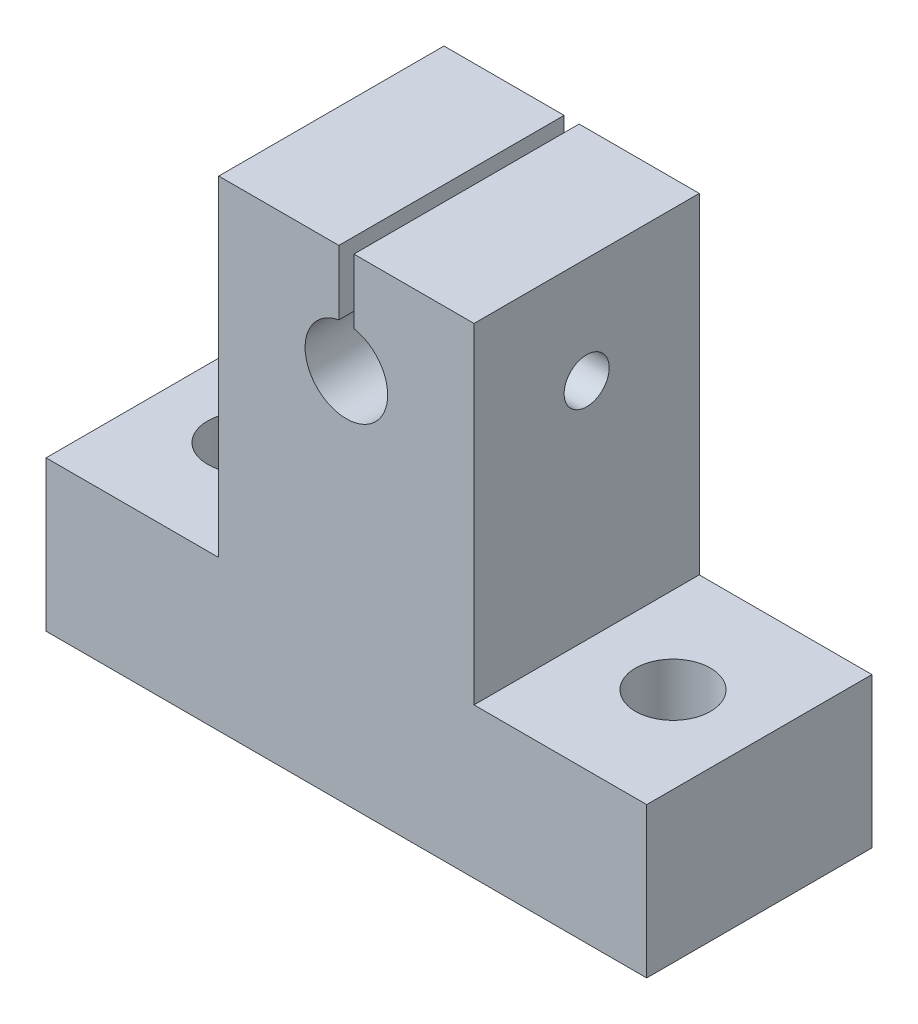
ISO-10303-21;
HEADER;
FILE_DESCRIPTION(('STEP AP214'),'2;1');
FILE_NAME('part.step','',(''),(''),'','','');
FILE_SCHEMA(('AUTOMOTIVE_DESIGN { 1 0 10303 214 1 1 1 1 }'));
ENDSEC;
DATA;
#1=APPLICATION_CONTEXT('core data for automotive mechanical design processes');
#2=APPLICATION_PROTOCOL_DEFINITION('international standard','automotive_design',2000,#1);
#3=PRODUCT_CONTEXT('',#1,'mechanical');
#4=PRODUCT('Part','Part','',(#3));
#5=PRODUCT_RELATED_PRODUCT_CATEGORY('part','',(#4));
#6=PRODUCT_DEFINITION_FORMATION('','',#4);
#7=PRODUCT_DEFINITION_CONTEXT('part definition',#1,'design');
#8=PRODUCT_DEFINITION('design','',#6,#7);
#9=PRODUCT_DEFINITION_SHAPE('','',#8);
#10=(LENGTH_UNIT() NAMED_UNIT(*) SI_UNIT(.MILLI.,.METRE.));
#11=(NAMED_UNIT(*) PLANE_ANGLE_UNIT() SI_UNIT($,.RADIAN.));
#12=(NAMED_UNIT(*) SI_UNIT($,.STERADIAN.) SOLID_ANGLE_UNIT());
#13=UNCERTAINTY_MEASURE_WITH_UNIT(LENGTH_MEASURE(1.E-05),#10,'distance_accuracy_value','');
#14=(GEOMETRIC_REPRESENTATION_CONTEXT(3) GLOBAL_UNCERTAINTY_ASSIGNED_CONTEXT((#13)) GLOBAL_UNIT_ASSIGNED_CONTEXT((#10,
#11,#12)) REPRESENTATION_CONTEXT('',''));
#15=CARTESIAN_POINT('',(0.,0.,0.));
#16=DIRECTION('',(0.,0.,1.));
#17=DIRECTION('',(1.,0.,0.));
#18=AXIS2_PLACEMENT_3D('',#15,#16,#17);
#19=CARTESIAN_POINT('',(0.,32.,0.));
#20=DIRECTION('',(0.,1.,0.));
#21=DIRECTION('',(0.,0.,1.));
#22=AXIS2_PLACEMENT_3D('',#19,#20,#21);
#23=PLANE('',#22);
#24=DIRECTION('',(1.,0.,0.));
#25=VECTOR('',#24,1.);
#26=CARTESIAN_POINT('',(0.,32.,7.5));
#27=LINE('',#26,#25);
#28=CARTESIAN_POINT('',(-8.5,32.,7.5));
#29=VERTEX_POINT('',#28);
#30=CARTESIAN_POINT('',(-0.5,32.,7.5));
#31=VERTEX_POINT('',#30);
#32=EDGE_CURVE('E202',#29,#31,#27,.T.);
#33=ORIENTED_EDGE('',*,*,#32,.T.);
#34=DIRECTION('',(0.,0.,-1.));
#35=VECTOR('',#34,1.);
#36=CARTESIAN_POINT('',(-0.5,32.,0.));
#37=LINE('',#36,#35);
#38=CARTESIAN_POINT('',(-0.5,32.,-7.5));
#39=VERTEX_POINT('',#38);
#40=EDGE_CURVE('E49',#31,#39,#37,.T.);
#41=ORIENTED_EDGE('',*,*,#40,.T.);
#42=DIRECTION('',(1.,0.,0.));
#43=VECTOR('',#42,1.);
#44=CARTESIAN_POINT('',(0.,32.,-7.5));
#45=LINE('',#44,#43);
#46=CARTESIAN_POINT('',(-8.5,32.,-7.5));
#47=VERTEX_POINT('',#46);
#48=EDGE_CURVE('E152',#47,#39,#45,.T.);
#49=ORIENTED_EDGE('',*,*,#48,.F.);
#50=DIRECTION('',(0.,0.,-1.));
#51=VECTOR('',#50,1.);
#52=CARTESIAN_POINT('',(-8.5,32.,0.));
#53=LINE('',#52,#51);
#54=EDGE_CURVE('E211',#29,#47,#53,.T.);
#55=ORIENTED_EDGE('',*,*,#54,.F.);
#56=EDGE_LOOP('',(#33,#41,#49,#55));
#57=FACE_BOUND('',#56,.T.);
#58=ADVANCED_FACE('F35',(#57),#23,.T.);
#59=CARTESIAN_POINT('',(0.,32.,7.5));
#60=DIRECTION('',(0.,0.,-1.));
#61=DIRECTION('',(-1.,0.,0.));
#62=AXIS2_PLACEMENT_3D('',#59,#60,#61);
#63=PLANE('',#62);
#64=CARTESIAN_POINT('',(0.5,32.,7.5));
#65=VERTEX_POINT('',#64);
#66=CARTESIAN_POINT('',(8.5,32.,7.5));
#67=VERTEX_POINT('',#66);
#68=EDGE_CURVE('E206',#65,#67,#27,.T.);
#69=ORIENTED_EDGE('',*,*,#68,.F.);
#70=DIRECTION('',(0.,-1.,0.));
#71=VECTOR('',#70,1.);
#72=CARTESIAN_POINT('',(0.5,32.,7.5));
#73=LINE('',#72,#71);
#74=CARTESIAN_POINT('',(0.5,27.704163456598,7.5));
#75=VERTEX_POINT('',#74);
#76=EDGE_CURVE('E159',#65,#75,#73,.T.);
#77=ORIENTED_EDGE('',*,*,#76,.T.);
#78=CARTESIAN_POINT('',(0.,25.,7.5));
#79=DIRECTION('',(0.,0.,-1.));
#80=DIRECTION('',(-1.,0.,0.));
#81=AXIS2_PLACEMENT_3D('',#78,#79,#80);
#82=CIRCLE('',#81,2.75);
#83=CARTESIAN_POINT('',(-0.500000000000001,27.704163456598,7.5));
#84=VERTEX_POINT('',#83);
#85=EDGE_CURVE('E162',#75,#84,#82,.T.);
#86=ORIENTED_EDGE('',*,*,#85,.T.);
#87=DIRECTION('',(0.,-1.,0.));
#88=VECTOR('',#87,1.);
#89=CARTESIAN_POINT('',(-0.5,32.,7.5));
#90=LINE('',#89,#88);
#91=EDGE_CURVE('E134',#31,#84,#90,.T.);
#92=ORIENTED_EDGE('',*,*,#91,.F.);
#93=ORIENTED_EDGE('',*,*,#32,.F.);
#94=DIRECTION('',(0.,-1.,0.));
#95=VECTOR('',#94,1.);
#96=CARTESIAN_POINT('',(-8.5,32.,7.5));
#97=LINE('',#96,#95);
#98=CARTESIAN_POINT('',(-8.5,10.,7.5));
#99=VERTEX_POINT('',#98);
#100=EDGE_CURVE('E214',#29,#99,#97,.T.);
#101=ORIENTED_EDGE('',*,*,#100,.T.);
#102=DIRECTION('',(1.,0.,0.));
#103=VECTOR('',#102,1.);
#104=CARTESIAN_POINT('',(0.,10.,7.5));
#105=LINE('',#104,#103);
#106=CARTESIAN_POINT('',(-20.,10.,7.5));
#107=VERTEX_POINT('',#106);
#108=EDGE_CURVE('E182',#107,#99,#105,.T.);
#109=ORIENTED_EDGE('',*,*,#108,.F.);
#110=DIRECTION('',(0.,-1.,0.));
#111=VECTOR('',#110,1.);
#112=CARTESIAN_POINT('',(-20.,10.,7.5));
#113=LINE('',#112,#111);
#114=CARTESIAN_POINT('',(-20.,0.,7.5));
#115=VERTEX_POINT('',#114);
#116=EDGE_CURVE('E193',#107,#115,#113,.T.);
#117=ORIENTED_EDGE('',*,*,#116,.T.);
#118=DIRECTION('',(1.,0.,0.));
#119=VECTOR('',#118,1.);
#120=CARTESIAN_POINT('',(0.,0.,7.5));
#121=LINE('',#120,#119);
#122=CARTESIAN_POINT('',(20.,0.,7.5));
#123=VERTEX_POINT('',#122);
#124=EDGE_CURVE('E201',#115,#123,#121,.T.);
#125=ORIENTED_EDGE('',*,*,#124,.T.);
#126=DIRECTION('',(0.,-1.,0.));
#127=VECTOR('',#126,1.);
#128=CARTESIAN_POINT('',(20.,10.,7.5));
#129=LINE('',#128,#127);
#130=CARTESIAN_POINT('',(20.,10.,7.5));
#131=VERTEX_POINT('',#130);
#132=EDGE_CURVE('E178',#131,#123,#129,.T.);
#133=ORIENTED_EDGE('',*,*,#132,.F.);
#134=DIRECTION('',(1.,0.,0.));
#135=VECTOR('',#134,1.);
#136=CARTESIAN_POINT('',(0.,10.,7.5));
#137=LINE('',#136,#135);
#138=CARTESIAN_POINT('',(8.5,10.,7.5));
#139=VERTEX_POINT('',#138);
#140=EDGE_CURVE('E167',#139,#131,#137,.T.);
#141=ORIENTED_EDGE('',*,*,#140,.F.);
#142=DIRECTION('',(0.,-1.,0.));
#143=VECTOR('',#142,1.);
#144=CARTESIAN_POINT('',(8.5,32.,7.5));
#145=LINE('',#144,#143);
#146=EDGE_CURVE('E225',#67,#139,#145,.T.);
#147=ORIENTED_EDGE('',*,*,#146,.F.);
#148=EDGE_LOOP('',(#69,#77,#86,#92,#93,#101,#109,#117,#125,#133,#141,#147));
#149=FACE_BOUND('',#148,.T.);
#150=ADVANCED_FACE('F37',(#149),#63,.F.);
#151=CARTESIAN_POINT('',(8.5,32.,0.));
#152=DIRECTION('',(-1.,0.,0.));
#153=DIRECTION('',(0.,0.,1.));
#154=AXIS2_PLACEMENT_3D('',#151,#152,#153);
#155=PLANE('',#154);
#156=CARTESIAN_POINT('',(8.5,24.9436180428333,0.));
#157=DIRECTION('',(-1.,0.,0.));
#158=DIRECTION('',(0.,0.,1.));
#159=AXIS2_PLACEMENT_3D('',#156,#157,#158);
#160=CIRCLE('',#159,1.5);
#161=CARTESIAN_POINT('',(8.5,24.9436180428333,1.5));
#162=VERTEX_POINT('',#161);
#163=EDGE_CURVE('E329',#162,#162,#160,.T.);
#164=ORIENTED_EDGE('',*,*,#163,.T.);
#165=EDGE_LOOP('',(#164));
#166=FACE_BOUND('',#165,.T.);
#167=ORIENTED_EDGE('',*,*,#146,.T.);
#168=DIRECTION('',(0.,0.,-1.));
#169=VECTOR('',#168,1.);
#170=CARTESIAN_POINT('',(8.5,10.,0.));
#171=LINE('',#170,#169);
#172=CARTESIAN_POINT('',(8.5,10.,-7.5));
#173=VERTEX_POINT('',#172);
#174=EDGE_CURVE('E165',#139,#173,#171,.T.);
#175=ORIENTED_EDGE('',*,*,#174,.T.);
#176=DIRECTION('',(0.,-1.,0.));
#177=VECTOR('',#176,1.);
#178=CARTESIAN_POINT('',(8.5,32.,-7.5));
#179=LINE('',#178,#177);
#180=CARTESIAN_POINT('',(8.5,32.,-7.5));
#181=VERTEX_POINT('',#180);
#182=EDGE_CURVE('E222',#181,#173,#179,.T.);
#183=ORIENTED_EDGE('',*,*,#182,.F.);
#184=DIRECTION('',(0.,0.,-1.));
#185=VECTOR('',#184,1.);
#186=CARTESIAN_POINT('',(8.5,32.,0.));
#187=LINE('',#186,#185);
#188=EDGE_CURVE('E205',#67,#181,#187,.T.);
#189=ORIENTED_EDGE('',*,*,#188,.F.);
#190=EDGE_LOOP('',(#167,#175,#183,#189));
#191=FACE_BOUND('',#190,.T.);
#192=ADVANCED_FACE('F265',(#166,#191),#155,.F.);
#193=CARTESIAN_POINT('',(0.,32.,-7.5));
#194=DIRECTION('',(0.,0.,-1.));
#195=DIRECTION('',(-1.,0.,0.));
#196=AXIS2_PLACEMENT_3D('',#193,#194,#195);
#197=PLANE('',#196);
#198=DIRECTION('',(0.,-1.,0.));
#199=VECTOR('',#198,1.);
#200=CARTESIAN_POINT('',(0.499999999999993,0.,-7.5));
#201=LINE('',#200,#199);
#202=CARTESIAN_POINT('',(0.5,32.,-7.5));
#203=VERTEX_POINT('',#202);
#204=CARTESIAN_POINT('',(0.5,27.704163456598,-7.5));
#205=VERTEX_POINT('',#204);
#206=EDGE_CURVE('E138',#203,#205,#201,.T.);
#207=ORIENTED_EDGE('',*,*,#206,.F.);
#208=EDGE_CURVE('E209',#203,#181,#45,.T.);
#209=ORIENTED_EDGE('',*,*,#208,.T.);
#210=ORIENTED_EDGE('',*,*,#182,.T.);
#211=DIRECTION('',(1.,0.,0.));
#212=VECTOR('',#211,1.);
#213=CARTESIAN_POINT('',(0.,10.,-7.5));
#214=LINE('',#213,#212);
#215=CARTESIAN_POINT('',(20.,10.,-7.5));
#216=VERTEX_POINT('',#215);
#217=EDGE_CURVE('E65',#173,#216,#214,.T.);
#218=ORIENTED_EDGE('',*,*,#217,.T.);
#219=DIRECTION('',(0.,-1.,0.));
#220=VECTOR('',#219,1.);
#221=CARTESIAN_POINT('',(20.,10.,-7.5));
#222=LINE('',#221,#220);
#223=CARTESIAN_POINT('',(20.,0.,-7.5));
#224=VERTEX_POINT('',#223);
#225=EDGE_CURVE('E173',#216,#224,#222,.T.);
#226=ORIENTED_EDGE('',*,*,#225,.T.);
#227=DIRECTION('',(1.,0.,0.));
#228=VECTOR('',#227,1.);
#229=CARTESIAN_POINT('',(0.,0.,-7.5));
#230=LINE('',#229,#228);
#231=CARTESIAN_POINT('',(-20.,0.,-7.5));
#232=VERTEX_POINT('',#231);
#233=EDGE_CURVE('E216',#232,#224,#230,.T.);
#234=ORIENTED_EDGE('',*,*,#233,.F.);
#235=DIRECTION('',(0.,-1.,0.));
#236=VECTOR('',#235,1.);
#237=CARTESIAN_POINT('',(-20.,10.,-7.5));
#238=LINE('',#237,#236);
#239=CARTESIAN_POINT('',(-20.,10.,-7.5));
#240=VERTEX_POINT('',#239);
#241=EDGE_CURVE('E198',#240,#232,#238,.T.);
#242=ORIENTED_EDGE('',*,*,#241,.F.);
#243=DIRECTION('',(1.,0.,0.));
#244=VECTOR('',#243,1.);
#245=CARTESIAN_POINT('',(0.,10.,-7.5));
#246=LINE('',#245,#244);
#247=CARTESIAN_POINT('',(-8.5,10.,-7.5));
#248=VERTEX_POINT('',#247);
#249=EDGE_CURVE('E188',#240,#248,#246,.T.);
#250=ORIENTED_EDGE('',*,*,#249,.T.);
#251=DIRECTION('',(0.,-1.,0.));
#252=VECTOR('',#251,1.);
#253=CARTESIAN_POINT('',(-8.5,32.,-7.5));
#254=LINE('',#253,#252);
#255=EDGE_CURVE('E220',#47,#248,#254,.T.);
#256=ORIENTED_EDGE('',*,*,#255,.F.);
#257=ORIENTED_EDGE('',*,*,#48,.T.);
#258=DIRECTION('',(0.,-1.,0.));
#259=VECTOR('',#258,1.);
#260=CARTESIAN_POINT('',(-0.500000000000001,0.,-7.5));
#261=LINE('',#260,#259);
#262=CARTESIAN_POINT('',(-0.500000000000001,27.704163456598,-7.5));
#263=VERTEX_POINT('',#262);
#264=EDGE_CURVE('E57',#39,#263,#261,.T.);
#265=ORIENTED_EDGE('',*,*,#264,.T.);
#266=CARTESIAN_POINT('',(0.,25.,-7.5));
#267=DIRECTION('',(0.,0.,-1.));
#268=DIRECTION('',(-1.,0.,0.));
#269=AXIS2_PLACEMENT_3D('',#266,#267,#268);
#270=CIRCLE('',#269,2.75);
#271=EDGE_CURVE('E141',#205,#263,#270,.T.);
#272=ORIENTED_EDGE('',*,*,#271,.F.);
#273=EDGE_LOOP('',(#207,#209,#210,#218,#226,#234,#242,#250,#256,#257,#265,#272));
#274=FACE_BOUND('',#273,.T.);
#275=ADVANCED_FACE('F150',(#274),#197,.T.);
#276=CARTESIAN_POINT('',(-8.5,32.,0.));
#277=DIRECTION('',(-1.,0.,0.));
#278=DIRECTION('',(0.,0.,1.));
#279=AXIS2_PLACEMENT_3D('',#276,#277,#278);
#280=PLANE('',#279);
#281=CARTESIAN_POINT('',(-8.5,24.9436180428333,0.));
#282=DIRECTION('',(-1.,0.,0.));
#283=DIRECTION('',(0.,0.,1.));
#284=AXIS2_PLACEMENT_3D('',#281,#282,#283);
#285=CIRCLE('',#284,1.5);
#286=CARTESIAN_POINT('',(-8.5,24.9436180428333,1.5));
#287=VERTEX_POINT('',#286);
#288=EDGE_CURVE('E233',#287,#287,#285,.T.);
#289=ORIENTED_EDGE('',*,*,#288,.F.);
#290=EDGE_LOOP('',(#289));
#291=FACE_BOUND('',#290,.T.);
#292=DIRECTION('',(0.,0.,-1.));
#293=VECTOR('',#292,1.);
#294=CARTESIAN_POINT('',(-8.5,10.,0.));
#295=LINE('',#294,#293);
#296=EDGE_CURVE('E185',#99,#248,#295,.T.);
#297=ORIENTED_EDGE('',*,*,#296,.F.);
#298=ORIENTED_EDGE('',*,*,#100,.F.);
#299=ORIENTED_EDGE('',*,*,#54,.T.);
#300=ORIENTED_EDGE('',*,*,#255,.T.);
#301=EDGE_LOOP('',(#297,#298,#299,#300));
#302=FACE_BOUND('',#301,.T.);
#303=ADVANCED_FACE('F271',(#291,#302),#280,.T.);
#304=DIRECTION('',(0.,0.,-1.));
#305=VECTOR('',#304,1.);
#306=CARTESIAN_POINT('',(0.5,32.,0.));
#307=LINE('',#306,#305);
#308=EDGE_CURVE('E11',#65,#203,#307,.T.);
#309=ORIENTED_EDGE('',*,*,#308,.F.);
#310=ORIENTED_EDGE('',*,*,#68,.T.);
#311=ORIENTED_EDGE('',*,*,#188,.T.);
#312=ORIENTED_EDGE('',*,*,#208,.F.);
#313=EDGE_LOOP('',(#309,#310,#311,#312));
#314=FACE_BOUND('',#313,.T.);
#315=ADVANCED_FACE('F261',(#314),#23,.T.);
#316=CARTESIAN_POINT('',(0.,0.,0.));
#317=DIRECTION('',(0.,1.,0.));
#318=DIRECTION('',(0.,0.,1.));
#319=AXIS2_PLACEMENT_3D('',#316,#317,#318);
#320=PLANE('',#319);
#321=CARTESIAN_POINT('',(14.25,0.,0.));
#322=DIRECTION('',(0.,1.,0.));
#323=DIRECTION('',(0.,0.,1.));
#324=AXIS2_PLACEMENT_3D('',#321,#322,#323);
#325=CIRCLE('',#324,2.5);
#326=CARTESIAN_POINT('',(14.25,0.,2.5));
#327=VERTEX_POINT('',#326);
#328=EDGE_CURVE('E323',#327,#327,#325,.T.);
#329=ORIENTED_EDGE('',*,*,#328,.T.);
#330=EDGE_LOOP('',(#329));
#331=FACE_BOUND('',#330,.T.);
#332=CARTESIAN_POINT('',(-14.25,0.,0.));
#333=DIRECTION('',(0.,1.,0.));
#334=DIRECTION('',(0.,0.,1.));
#335=AXIS2_PLACEMENT_3D('',#332,#333,#334);
#336=CIRCLE('',#335,2.5);
#337=CARTESIAN_POINT('',(-14.25,0.,2.5));
#338=VERTEX_POINT('',#337);
#339=EDGE_CURVE('E147',#338,#338,#336,.T.);
#340=ORIENTED_EDGE('',*,*,#339,.T.);
#341=EDGE_LOOP('',(#340));
#342=FACE_BOUND('',#341,.T.);
#343=ORIENTED_EDGE('',*,*,#124,.F.);
#344=DIRECTION('',(0.,0.,1.));
#345=VECTOR('',#344,1.);
#346=CARTESIAN_POINT('',(-20.,0.,0.));
#347=LINE('',#346,#345);
#348=EDGE_CURVE('E181',#232,#115,#347,.T.);
#349=ORIENTED_EDGE('',*,*,#348,.F.);
#350=ORIENTED_EDGE('',*,*,#233,.T.);
#351=DIRECTION('',(0.,0.,1.));
#352=VECTOR('',#351,1.);
#353=CARTESIAN_POINT('',(20.,0.,0.));
#354=LINE('',#353,#352);
#355=EDGE_CURVE('E164',#224,#123,#354,.T.);
#356=ORIENTED_EDGE('',*,*,#355,.T.);
#357=EDGE_LOOP('',(#343,#349,#350,#356));
#358=FACE_BOUND('',#357,.T.);
#359=ADVANCED_FACE('F270',(#331,#342,#358),#320,.F.);
#360=CARTESIAN_POINT('',(-20.,10.,0.));
#361=DIRECTION('',(1.,0.,0.));
#362=DIRECTION('',(0.,0.,-1.));
#363=AXIS2_PLACEMENT_3D('',#360,#361,#362);
#364=PLANE('',#363);
#365=ORIENTED_EDGE('',*,*,#348,.T.);
#366=ORIENTED_EDGE('',*,*,#116,.F.);
#367=DIRECTION('',(0.,0.,1.));
#368=VECTOR('',#367,1.);
#369=CARTESIAN_POINT('',(-20.,10.,0.));
#370=LINE('',#369,#368);
#371=EDGE_CURVE('E191',#240,#107,#370,.T.);
#372=ORIENTED_EDGE('',*,*,#371,.F.);
#373=ORIENTED_EDGE('',*,*,#241,.T.);
#374=EDGE_LOOP('',(#365,#366,#372,#373));
#375=FACE_BOUND('',#374,.T.);
#376=ADVANCED_FACE('F277',(#375),#364,.F.);
#377=CARTESIAN_POINT('',(0.,10.,0.));
#378=DIRECTION('',(0.,1.,0.));
#379=DIRECTION('',(0.,0.,1.));
#380=AXIS2_PLACEMENT_3D('',#377,#378,#379);
#381=PLANE('',#380);
#382=CARTESIAN_POINT('',(-14.25,10.,0.));
#383=DIRECTION('',(0.,1.,0.));
#384=DIRECTION('',(0.,0.,-1.));
#385=AXIS2_PLACEMENT_3D('',#382,#383,#384);
#386=CIRCLE('',#385,2.5);
#387=CARTESIAN_POINT('',(-14.25,10.,-2.5));
#388=VERTEX_POINT('',#387);
#389=EDGE_CURVE('E324',#388,#388,#386,.T.);
#390=ORIENTED_EDGE('',*,*,#389,.F.);
#391=EDGE_LOOP('',(#390));
#392=FACE_BOUND('',#391,.T.);
#393=ORIENTED_EDGE('',*,*,#108,.T.);
#394=ORIENTED_EDGE('',*,*,#296,.T.);
#395=ORIENTED_EDGE('',*,*,#249,.F.);
#396=ORIENTED_EDGE('',*,*,#371,.T.);
#397=EDGE_LOOP('',(#393,#394,#395,#396));
#398=FACE_BOUND('',#397,.T.);
#399=ADVANCED_FACE('F300',(#392,#398),#381,.T.);
#400=CARTESIAN_POINT('',(20.,10.,0.));
#401=DIRECTION('',(1.,0.,0.));
#402=DIRECTION('',(0.,0.,-1.));
#403=AXIS2_PLACEMENT_3D('',#400,#401,#402);
#404=PLANE('',#403);
#405=ORIENTED_EDGE('',*,*,#355,.F.);
#406=ORIENTED_EDGE('',*,*,#225,.F.);
#407=DIRECTION('',(0.,0.,1.));
#408=VECTOR('',#407,1.);
#409=CARTESIAN_POINT('',(20.,10.,0.));
#410=LINE('',#409,#408);
#411=EDGE_CURVE('E169',#216,#131,#410,.T.);
#412=ORIENTED_EDGE('',*,*,#411,.T.);
#413=ORIENTED_EDGE('',*,*,#132,.T.);
#414=EDGE_LOOP('',(#405,#406,#412,#413));
#415=FACE_BOUND('',#414,.T.);
#416=ADVANCED_FACE('F291',(#415),#404,.T.);
#417=CARTESIAN_POINT('',(0.,10.,0.));
#418=DIRECTION('',(0.,1.,0.));
#419=DIRECTION('',(0.,0.,1.));
#420=AXIS2_PLACEMENT_3D('',#417,#418,#419);
#421=PLANE('',#420);
#422=CARTESIAN_POINT('',(14.25,10.,0.));
#423=DIRECTION('',(0.,1.,0.));
#424=DIRECTION('',(0.,0.,1.));
#425=AXIS2_PLACEMENT_3D('',#422,#423,#424);
#426=CIRCLE('',#425,2.5);
#427=CARTESIAN_POINT('',(14.25,10.,2.5));
#428=VERTEX_POINT('',#427);
#429=EDGE_CURVE('E322',#428,#428,#426,.T.);
#430=ORIENTED_EDGE('',*,*,#429,.F.);
#431=EDGE_LOOP('',(#430));
#432=FACE_BOUND('',#431,.T.);
#433=ORIENTED_EDGE('',*,*,#174,.F.);
#434=ORIENTED_EDGE('',*,*,#140,.T.);
#435=ORIENTED_EDGE('',*,*,#411,.F.);
#436=ORIENTED_EDGE('',*,*,#217,.F.);
#437=EDGE_LOOP('',(#433,#434,#435,#436));
#438=FACE_BOUND('',#437,.T.);
#439=ADVANCED_FACE('F311',(#432,#438),#421,.T.);
#440=CARTESIAN_POINT('',(0.,25.,12.5));
#441=DIRECTION('',(0.,0.,-1.));
#442=DIRECTION('',(-1.,0.,0.));
#443=AXIS2_PLACEMENT_3D('',#440,#441,#442);
#444=CYLINDRICAL_SURFACE('',#443,2.75);
#445=CARTESIAN_POINT('',(2.74942195286683,24.9436180428333,1.5));
#446=CARTESIAN_POINT('',(2.74780994298594,24.8651603065944,1.49999666808403));
#447=CARTESIAN_POINT('',(2.74281253818867,24.7867393463085,1.49381205184298));
#448=CARTESIAN_POINT('',(2.72643364538079,24.6324455253908,1.46945102850411));
#449=CARTESIAN_POINT('',(2.71504646062532,24.5565750026405,1.45126391815058));
#450=CARTESIAN_POINT('',(2.68695162201749,24.4097825184576,1.4039038082041));
#451=CARTESIAN_POINT('',(2.67026596617476,24.3388415491667,1.37477614140162));
#452=CARTESIAN_POINT('',(2.63293165717237,24.2030449540293,1.30664782777091));
#453=CARTESIAN_POINT('',(2.61228252022266,24.1381900725026,1.2676459754952));
#454=CARTESIAN_POINT('',(2.56699288348636,24.0110995752466,1.17767047267217));
#455=CARTESIAN_POINT('',(2.54217099941693,23.9494014475483,1.126030374022));
#456=CARTESIAN_POINT('',(2.49186443879476,23.8350879490579,1.01370240767227));
#457=CARTESIAN_POINT('',(2.46637907720111,23.7824824320364,0.953004855350571));
#458=CARTESIAN_POINT('',(2.41466871853818,23.6826804669199,0.817199433694687));
#459=CARTESIAN_POINT('',(2.38861430383793,23.6365130638958,0.741263305707383));
#460=CARTESIAN_POINT('',(2.34198665078047,23.5578828022,0.581087496791049));
#461=CARTESIAN_POINT('',(2.32140452638335,23.5253976751705,0.496861585602369));
#462=CARTESIAN_POINT('',(2.2927989713511,23.4814152118164,0.341931306252997));
#463=CARTESIAN_POINT('',(2.28299475113101,23.4668458691219,0.272426924685991));
#464=CARTESIAN_POINT('',(2.27002560426985,23.4477034945355,0.131471175047148));
#465=CARTESIAN_POINT('',(2.26685414257314,23.4431206230898,0.0600217937230128));
#466=CARTESIAN_POINT('',(2.26759624649362,23.4442021260811,-0.0828248895193206));
#467=CARTESIAN_POINT('',(2.27151651077913,23.44987618896,-0.154222078403589));
#468=CARTESIAN_POINT('',(2.28589427605362,23.4711618249669,-0.294853648240648));
#469=CARTESIAN_POINT('',(2.29635619568147,23.4867801151717,-0.364086534073229));
#470=CARTESIAN_POINT('',(2.3225430273626,23.5272912317331,-0.499003557934274));
#471=CARTESIAN_POINT('',(2.33828917445546,23.5522215254678,-0.564672115284417));
#472=CARTESIAN_POINT('',(2.37337908542346,23.6104941724601,-0.691109976272131));
#473=CARTESIAN_POINT('',(2.3927242503295,23.6438398034608,-0.751877358721919));
#474=CARTESIAN_POINT('',(2.43658757278773,23.7240904861656,-0.876992537597775));
#475=CARTESIAN_POINT('',(2.46143980324184,23.7723065266164,-0.940383635633384));
#476=CARTESIAN_POINT('',(2.51142262964625,23.8780894140214,-1.05875272166576));
#477=CARTESIAN_POINT('',(2.53655343701541,23.9356638911361,-1.11372377295498));
#478=CARTESIAN_POINT('',(2.58757859571646,24.0660065223269,-1.219667638106));
#479=CARTESIAN_POINT('',(2.61326031405859,24.1397451965394,-1.26956076234866));
#480=CARTESIAN_POINT('',(2.65963762230422,24.2961105097863,-1.35598584962031));
#481=CARTESIAN_POINT('',(2.68033620097033,24.3787317780273,-1.39252582837843));
#482=CARTESIAN_POINT('',(2.71330312260628,24.5448438657222,-1.44849435283221));
#483=CARTESIAN_POINT('',(2.72604222523469,24.6279079611889,-1.46890285311225));
#484=CARTESIAN_POINT('',(2.74381705669967,24.7970794484737,-1.49527092608967));
#485=CARTESIAN_POINT('',(2.74885991323652,24.8831839487677,-1.50124387093894));
#486=CARTESIAN_POINT('',(2.75068275702136,25.0452276287224,-1.49848958350167));
#487=CARTESIAN_POINT('',(2.74835125481495,25.1211902952109,-1.49138321004357));
#488=CARTESIAN_POINT('',(2.73766626453709,25.2707430892337,-1.46585885591628));
#489=CARTESIAN_POINT('',(2.72931274096026,25.3443332027771,-1.44744080855443));
#490=CARTESIAN_POINT('',(2.70757766213815,25.4864634769044,-1.40031161745465));
#491=CARTESIAN_POINT('',(2.69424825426904,25.5550474854724,-1.37170736381847));
#492=CARTESIAN_POINT('',(2.66376923857158,25.6865839211244,-1.30515896033441));
#493=CARTESIAN_POINT('',(2.64661859451008,25.7495348141318,-1.2672122767364));
#494=CARTESIAN_POINT('',(2.60815086644517,25.8744828574712,-1.17893542328704));
#495=CARTESIAN_POINT('',(2.58659223633743,25.9358137865795,-1.1277683140601));
#496=CARTESIAN_POINT('',(2.54259114144402,26.0495017782056,-1.01654101832257));
#497=CARTESIAN_POINT('',(2.52014789550531,26.1018506805442,-0.956472836528957));
#498=CARTESIAN_POINT('',(2.47452757176097,26.2010258920869,-0.822497599534768));
#499=CARTESIAN_POINT('',(2.45147745402077,26.2468809836965,-0.747822218245933));
#500=CARTESIAN_POINT('',(2.41001652604637,26.3252535900134,-0.590579861274437));
#501=CARTESIAN_POINT('',(2.39160256234853,26.3577801801301,-0.508018302699665));
#502=CARTESIAN_POINT('',(2.36320748779237,26.4065972383203,-0.341735523562564));
#503=CARTESIAN_POINT('',(2.35282614129014,26.4236667600204,-0.258315423045763));
#504=CARTESIAN_POINT('',(2.3407956541286,26.4433725496187,-0.0892083843596934));
#505=CARTESIAN_POINT('',(2.33913563517518,26.446026798128,-0.00352440418436693));
#506=CARTESIAN_POINT('',(2.34443464502955,26.4374043750002,0.155005127319527));
#507=CARTESIAN_POINT('',(2.35024397190692,26.4279865015363,0.228001276551205));
#508=CARTESIAN_POINT('',(2.36772585312969,26.3988068658745,0.371167304768433));
#509=CARTESIAN_POINT('',(2.37940070970114,26.3790410419681,0.441336062309374));
#510=CARTESIAN_POINT('',(2.40743533925781,26.3295011225163,0.578582628440526));
#511=CARTESIAN_POINT('',(2.4238804617081,26.2995428032473,0.645575629106248));
#512=CARTESIAN_POINT('',(2.45959318984442,26.2306123488038,0.773923864755113));
#513=CARTESIAN_POINT('',(2.47886201154853,26.1916363259738,0.835276652178567));
#514=CARTESIAN_POINT('',(2.52129679524557,26.0993146074498,0.959788946166222));
#515=CARTESIAN_POINT('',(2.54462734086523,26.0447137594904,1.02196517879926));
#516=CARTESIAN_POINT('',(2.59026571898196,25.9257870091494,1.13674004975331));
#517=CARTESIAN_POINT('',(2.61257281099122,25.8614542057429,1.18933183283278));
#518=CARTESIAN_POINT('',(2.6550086905823,25.7205064859556,1.28613344454098));
#519=CARTESIAN_POINT('',(2.6749545829577,25.6434156751549,1.32973661785048));
#520=CARTESIAN_POINT('',(2.70873705781842,25.4816907496832,1.40296847697141));
#521=CARTESIAN_POINT('',(2.72258480956396,25.3970707700608,1.43262271828159));
#522=CARTESIAN_POINT('',(2.73922716155124,25.2505025524958,1.46956152880121));
#523=CARTESIAN_POINT('',(2.74412869108765,25.189799029684,1.48094888226772));
#524=CARTESIAN_POINT('',(2.74986072065983,25.0672619453579,1.49616877615629));
#525=CARTESIAN_POINT('',(2.75069192576845,25.0054285814206,1.50000262494855));
#526=CARTESIAN_POINT('',(2.74942195286683,24.9436180428333,1.5));
#527=B_SPLINE_CURVE_WITH_KNOTS('',3,(#445,#446,#447,#448,#449,#450,#451,#452,#453,#454,#455,
#456,#457,#458,#459,#460,#461,#462,#463,#464,#465,#466,#467,#468,#469,#470,#471,#472,#473,#474,
#475,#476,#477,#478,#479,#480,#481,#482,#483,#484,#485,#486,#487,#488,#489,#490,#491,#492,#493,
#494,#495,#496,#497,#498,#499,#500,#501,#502,#503,#504,#505,#506,#507,#508,#509,#510,#511,#512,
#513,#514,#515,#516,#517,#518,#519,#520,#521,#522,#523,#524,#525,#526),.UNSPECIFIED.,.T.,.F.,(4,
2,2,2,2,2,2,2,2,2,2,2,2,2,2,2,2,2,2,2,2,2,2,2,2,2,2,2,2,2,2,2,2,2,2,2,2,2,2,2,4),(0.,
0.235176465806353,0.470562934742717,0.704984637952997,0.939434973340526,1.19101317342184,
1.44286232530023,1.71929215381863,1.99527032868631,2.20939870892397,2.42331601538506,
2.63743548834126,2.85169974730946,3.06683556362955,3.28205530424039,3.53135415225667,
3.78085728872653,4.0574118954475,4.33380021607215,4.59172667802187,4.84941412207926,
5.0772870301745,5.30516128180174,5.53071155128967,5.75632305953339,6.00349803496168,
6.25089639353483,6.5213813583339,6.79168184199189,7.04744659987699,7.30289226116311,
7.52334032486372,7.74387498231797,7.968628442189,8.19347897749805,8.45029728551088,
8.70729856704183,8.97819019991598,9.24858358701615,9.4338923056912,9.6191689235418),.UNSPECIFIED.);
#528=CARTESIAN_POINT('',(2.74942195286683,24.9436180428333,1.5));
#529=VERTEX_POINT('',#528);
#530=EDGE_CURVE('E39',#529,#529,#527,.T.);
#531=ORIENTED_EDGE('',*,*,#530,.T.);
#532=EDGE_LOOP('',(#531));
#533=FACE_BOUND('',#532,.T.);
#534=CARTESIAN_POINT('',(-2.74942195286683,24.9436180428333,1.5));
#535=CARTESIAN_POINT('',(-2.75100796080208,25.0211678547872,1.4999951932758));
#536=CARTESIAN_POINT('',(-2.74928972875267,25.0988475206261,1.49395178349876));
#537=CARTESIAN_POINT('',(-2.73950878599039,25.2519956307342,1.47000984372709));
#538=CARTESIAN_POINT('',(-2.73143785141817,25.3274610771515,1.4520959516156));
#539=CARTESIAN_POINT('',(-2.70989268358582,25.4737393144375,1.40529259791977));
#540=CARTESIAN_POINT('',(-2.69643904510719,25.5445686551371,1.37644499176782));
#541=CARTESIAN_POINT('',(-2.66543378618536,25.6803067435068,1.30883359140031));
#542=CARTESIAN_POINT('',(-2.64788189645787,25.7452151017362,1.2700691455618));
#543=CARTESIAN_POINT('',(-2.609019139325,25.8718835245217,1.18097107800556));
#544=CARTESIAN_POINT('',(-2.58754092225134,25.9331861763253,1.13006160039044));
#545=CARTESIAN_POINT('',(-2.54367415772909,26.0468723618762,1.01937883695415));
#546=CARTESIAN_POINT('',(-2.52128487338951,26.0992484906053,0.959598268253721));
#547=CARTESIAN_POINT('',(-2.47567747261151,26.1986618874604,0.826096775968924));
#548=CARTESIAN_POINT('',(-2.45258500480816,26.2447089145285,0.751589321046078));
#549=CARTESIAN_POINT('',(-2.41098309562598,26.3235016137557,0.59465584741027));
#550=CARTESIAN_POINT('',(-2.39247080005275,26.3562555778527,0.512234804834232));
#551=CARTESIAN_POINT('',(-2.36381313745845,26.4055851439062,0.346060456406415));
#552=CARTESIAN_POINT('',(-2.35328056860743,26.4229177743504,0.262602657352776));
#553=CARTESIAN_POINT('',(-2.34094981423154,26.4431249804895,0.0933620602076723));
#554=CARTESIAN_POINT('',(-2.33914048730539,26.4460179987506,0.00758236862732805));
#555=CARTESIAN_POINT('',(-2.34418941834214,26.437803572196,-0.15113724643243));
#556=CARTESIAN_POINT('',(-2.34989075820103,26.4285654165078,-0.22422174304841));
#557=CARTESIAN_POINT('',(-2.36718620568904,26.3997176193462,-0.367591435485793));
#558=CARTESIAN_POINT('',(-2.37878264402479,26.3801038756197,-0.437875512262351));
#559=CARTESIAN_POINT('',(-2.40666882381361,26.3308838104895,-0.57525265637408));
#560=CARTESIAN_POINT('',(-2.42303683220091,26.3011093082107,-0.642268770554074));
#561=CARTESIAN_POINT('',(-2.4586204971549,26.2325484662662,-0.770689915918568));
#562=CARTESIAN_POINT('',(-2.47783740563647,26.1937581604374,-0.832092461012464));
#563=CARTESIAN_POINT('',(-2.52019024615946,26.1018383621458,-0.956735438304999));
#564=CARTESIAN_POINT('',(-2.54349500580556,26.047454476687,-1.01899686580398));
#565=CARTESIAN_POINT('',(-2.58911967506022,25.9289732466796,-1.13397278199104));
#566=CARTESIAN_POINT('',(-2.61143900616981,25.8648702919006,-1.18668171777405));
#567=CARTESIAN_POINT('',(-2.65396690628107,25.7243166513831,-1.28382095226039));
#568=CARTESIAN_POINT('',(-2.67399181095012,25.6473806864235,-1.32763630739144));
#569=CARTESIAN_POINT('',(-2.70798797924,25.4858860878843,-1.40135756517416));
#570=CARTESIAN_POINT('',(-2.72196485490027,25.4013346092479,-1.43127636450905));
#571=CARTESIAN_POINT('',(-2.74105924353101,25.235401065031,-1.47360207467316));
#572=CARTESIAN_POINT('',(-2.74687602770852,25.154448020567,-1.48737163932577));
#573=CARTESIAN_POINT('',(-2.75119510191109,24.9912017957733,-1.50147803146533));
#574=CARTESIAN_POINT('',(-2.74970141656131,24.908909377674,-1.50182224905856));
#575=CARTESIAN_POINT('',(-2.73990750901668,24.753091642757,-1.48971911293594));
#576=CARTESIAN_POINT('',(-2.73222165306488,24.6794352092518,-1.47840163726709));
#577=CARTESIAN_POINT('',(-2.71143666912792,24.5353361157864,-1.44525893575893));
#578=CARTESIAN_POINT('',(-2.69833685494602,24.4648938644677,-1.42343237787919));
#579=CARTESIAN_POINT('',(-2.66727232777724,24.3267009993505,-1.36933964911416));
#580=CARTESIAN_POINT('',(-2.64917029873117,24.2590999463637,-1.33677285844331));
#581=CARTESIAN_POINT('',(-2.60969052278031,24.1301912451657,-1.26248878650818));
#582=CARTESIAN_POINT('',(-2.58831152664095,24.0688860119733,-1.22076801296482));
#583=CARTESIAN_POINT('',(-2.54124228237813,23.9467429236835,-1.12383423998061));
#584=CARTESIAN_POINT('',(-2.51533951463974,23.8867821576864,-1.06761807028284));
#585=CARTESIAN_POINT('',(-2.46369151057498,23.7767140259211,-0.946080235185888));
#586=CARTESIAN_POINT('',(-2.43794648051424,23.7266176476583,-0.880748553215946));
#587=CARTESIAN_POINT('',(-2.38737916459468,23.6340174807157,-0.736757471032357));
#588=CARTESIAN_POINT('',(-2.36277225731567,23.5923692105129,-0.65746498882806));
#589=CARTESIAN_POINT('',(-2.32035496405074,23.5234811122367,-0.491195557826167));
#590=CARTESIAN_POINT('',(-2.30253313831498,23.4962170020353,-0.404231850567355));
#591=CARTESIAN_POINT('',(-2.27838668951555,23.4599075458382,-0.235052684784496));
#592=CARTESIAN_POINT('',(-2.27102370614827,23.4492052680581,-0.15334712763393));
#593=CARTESIAN_POINT('',(-2.26568528328876,23.4414103026771,0.0109901270170274));
#594=CARTESIAN_POINT('',(-2.26770171325684,23.4443058278485,0.0936209604698608));
#595=CARTESIAN_POINT('',(-2.2797631078653,23.4620599524171,0.244822834079556));
#596=CARTESIAN_POINT('',(-2.28861658891624,23.475145397286,0.313712288648123));
#597=CARTESIAN_POINT('',(-2.31174446733819,23.5104428607116,0.448153766299339));
#598=CARTESIAN_POINT('',(-2.32602114688996,23.5326587218368,0.513704371144749));
#599=CARTESIAN_POINT('',(-2.35957228864828,23.5871993067956,0.644587821967927));
#600=CARTESIAN_POINT('',(-2.37911964443672,23.6201065276005,0.709605553928141));
#601=CARTESIAN_POINT('',(-2.42074321390318,23.6945040143558,0.833637076992328));
#602=CARTESIAN_POINT('',(-2.44282077677461,23.7359988691197,0.892647632899535));
#603=CARTESIAN_POINT('',(-2.49148513484717,23.8344547550736,1.01330706146322));
#604=CARTESIAN_POINT('',(-2.51820806012461,23.8928420463082,1.07374370520103));
#605=CARTESIAN_POINT('',(-2.57010651683404,24.0193230065817,1.18437374444085));
#606=CARTESIAN_POINT('',(-2.59528079817654,24.0874243735601,1.23455893871181));
#607=CARTESIAN_POINT('',(-2.6427113781525,24.2352419083197,1.32515481014331));
#608=CARTESIAN_POINT('',(-2.664795180481,24.3153321312596,1.3650510718496));
#609=CARTESIAN_POINT('',(-2.70223996837556,24.4826138098113,1.43020333363598));
#610=CARTESIAN_POINT('',(-2.7176184861899,24.5697860306601,1.45549757036435));
#611=CARTESIAN_POINT('',(-2.73460663953473,24.7056197334257,1.48176545823364));
#612=CARTESIAN_POINT('',(-2.73928543541697,24.7528396882652,1.48858475139434));
#613=CARTESIAN_POINT('',(-2.74620341815092,24.8478959412587,1.49770349468814));
#614=CARTESIAN_POINT('',(-2.74844261755538,24.8957322362401,1.50000296807767));
#615=CARTESIAN_POINT('',(-2.74942195286683,24.9436180428333,1.5));
#616=B_SPLINE_CURVE_WITH_KNOTS('',3,(#534,#535,#536,#537,#538,#539,#540,#541,#542,#543,#544,
#545,#546,#547,#548,#549,#550,#551,#552,#553,#554,#555,#556,#557,#558,#559,#560,#561,#562,#563,
#564,#565,#566,#567,#568,#569,#570,#571,#572,#573,#574,#575,#576,#577,#578,#579,#580,#581,#582,
#583,#584,#585,#586,#587,#588,#589,#590,#591,#592,#593,#594,#595,#596,#597,#598,#599,#600,#601,
#602,#603,#604,#605,#606,#607,#608,#609,#610,#611,#612,#613,#614,#615),.UNSPECIFIED.,.T.,.F.,(4,
2,2,2,2,2,2,2,2,2,2,2,2,2,2,2,2,2,2,2,2,2,2,2,2,2,2,2,2,2,2,2,2,2,2,2,2,2,2,2,4),(0.,
0.232506959600831,0.465315405949591,0.697241493470375,0.92918282447628,1.1757661087735,
1.42255296155446,1.69295130561221,1.96318072056577,2.21926671583395,2.47502554901509,
2.69563842962634,2.91633860042744,3.14088484018878,3.36553004819775,3.62210170099811,
3.8788220249449,4.14966513990077,4.42025639449269,4.66584513337181,4.91129868375223,
5.13501956933897,5.35876881931905,5.58940426343572,5.82012784931277,6.0775831555255,
6.3353236275049,6.61246762353244,6.88914225918493,7.1357716984606,7.38218738699392,
7.59330352076998,7.80450859465888,8.03001072623935,8.25563366774799,8.51902911200643,
8.78263445625403,9.05759949421245,9.33184120799068,9.47541138962085,9.6189808325182),.UNSPECIFIED.);
#617=CARTESIAN_POINT('',(-2.74942195286683,24.9436180428333,1.5));
#618=VERTEX_POINT('',#617);
#619=EDGE_CURVE('E228',#618,#618,#616,.T.);
#620=ORIENTED_EDGE('',*,*,#619,.T.);
#621=EDGE_LOOP('',(#620));
#622=FACE_BOUND('',#621,.T.);
#623=DIRECTION('',(0.,0.,-1.));
#624=VECTOR('',#623,1.);
#625=CARTESIAN_POINT('',(0.5,27.704163456598,12.5));
#626=LINE('',#625,#624);
#627=EDGE_CURVE('E137',#75,#205,#626,.T.);
#628=ORIENTED_EDGE('',*,*,#627,.T.);
#629=ORIENTED_EDGE('',*,*,#271,.T.);
#630=DIRECTION('',(0.,0.,-1.));
#631=VECTOR('',#630,1.);
#632=CARTESIAN_POINT('',(-0.500000000000001,27.704163456598,12.5));
#633=LINE('',#632,#631);
#634=EDGE_CURVE('E130',#84,#263,#633,.T.);
#635=ORIENTED_EDGE('',*,*,#634,.F.);
#636=ORIENTED_EDGE('',*,*,#85,.F.);
#637=EDGE_LOOP('',(#628,#629,#635,#636));
#638=FACE_BOUND('',#637,.T.);
#639=ADVANCED_FACE('F142',(#533,#622,#638),#444,.F.);
#640=CARTESIAN_POINT('',(0.499999999999993,0.,12.5));
#641=DIRECTION('',(1.,0.,0.));
#642=DIRECTION('',(0.,1.,0.));
#643=AXIS2_PLACEMENT_3D('',#640,#641,#642);
#644=PLANE('',#643);
#645=ORIENTED_EDGE('',*,*,#308,.T.);
#646=ORIENTED_EDGE('',*,*,#206,.T.);
#647=ORIENTED_EDGE('',*,*,#627,.F.);
#648=ORIENTED_EDGE('',*,*,#76,.F.);
#649=EDGE_LOOP('',(#645,#646,#647,#648));
#650=FACE_BOUND('',#649,.T.);
#651=ADVANCED_FACE('F252',(#650),#644,.F.);
#652=CARTESIAN_POINT('',(-0.500000000000001,0.,12.5));
#653=DIRECTION('',(1.,0.,0.));
#654=DIRECTION('',(0.,1.,0.));
#655=AXIS2_PLACEMENT_3D('',#652,#653,#654);
#656=PLANE('',#655);
#657=ORIENTED_EDGE('',*,*,#91,.T.);
#658=ORIENTED_EDGE('',*,*,#634,.T.);
#659=ORIENTED_EDGE('',*,*,#264,.F.);
#660=ORIENTED_EDGE('',*,*,#40,.F.);
#661=EDGE_LOOP('',(#657,#658,#659,#660));
#662=FACE_BOUND('',#661,.T.);
#663=ADVANCED_FACE('F132',(#662),#656,.T.);
#664=CARTESIAN_POINT('',(14.25,-10.,0.));
#665=DIRECTION('',(0.,1.,0.));
#666=DIRECTION('',(0.,0.,1.));
#667=AXIS2_PLACEMENT_3D('',#664,#665,#666);
#668=CYLINDRICAL_SURFACE('',#667,2.5);
#669=ORIENTED_EDGE('',*,*,#429,.T.);
#670=EDGE_LOOP('',(#669));
#671=FACE_BOUND('',#670,.T.);
#672=ORIENTED_EDGE('',*,*,#328,.F.);
#673=EDGE_LOOP('',(#672));
#674=FACE_BOUND('',#673,.T.);
#675=ADVANCED_FACE('F243',(#671,#674),#668,.F.);
#676=CARTESIAN_POINT('',(-14.25,-10.,0.));
#677=DIRECTION('',(0.,1.,0.));
#678=DIRECTION('',(0.,0.,1.));
#679=AXIS2_PLACEMENT_3D('',#676,#677,#678);
#680=CYLINDRICAL_SURFACE('',#679,2.5);
#681=ORIENTED_EDGE('',*,*,#389,.T.);
#682=EDGE_LOOP('',(#681));
#683=FACE_BOUND('',#682,.T.);
#684=ORIENTED_EDGE('',*,*,#339,.F.);
#685=EDGE_LOOP('',(#684));
#686=FACE_BOUND('',#685,.T.);
#687=ADVANCED_FACE('F247',(#683,#686),#680,.F.);
#688=CARTESIAN_POINT('',(11.5,24.9436180428333,0.));
#689=DIRECTION('',(-1.,0.,0.));
#690=DIRECTION('',(0.,0.,1.));
#691=AXIS2_PLACEMENT_3D('',#688,#689,#690);
#692=CYLINDRICAL_SURFACE('',#691,1.5);
#693=ORIENTED_EDGE('',*,*,#288,.T.);
#694=EDGE_LOOP('',(#693));
#695=FACE_BOUND('',#694,.T.);
#696=ORIENTED_EDGE('',*,*,#619,.F.);
#697=EDGE_LOOP('',(#696));
#698=FACE_BOUND('',#697,.T.);
#699=ADVANCED_FACE('F241',(#695,#698),#692,.F.);
#700=ORIENTED_EDGE('',*,*,#530,.F.);
#701=EDGE_LOOP('',(#700));
#702=FACE_BOUND('',#701,.T.);
#703=ORIENTED_EDGE('',*,*,#163,.F.);
#704=EDGE_LOOP('',(#703));
#705=FACE_BOUND('',#704,.T.);
#706=ADVANCED_FACE('F237',(#702,#705),#692,.F.);
#707=CLOSED_SHELL('',(#58,#150,#192,#275,#303,#315,#359,#376,#399,#416,#439,#639,#651,#663,#675,
#687,#699,#706));
#708=MANIFOLD_SOLID_BREP('B2',#707);
#709=ADVANCED_BREP_SHAPE_REPRESENTATION('',(#18,#708),#14);
#710=SHAPE_DEFINITION_REPRESENTATION(#9,#709);
ENDSEC;
END-ISO-10303-21;
